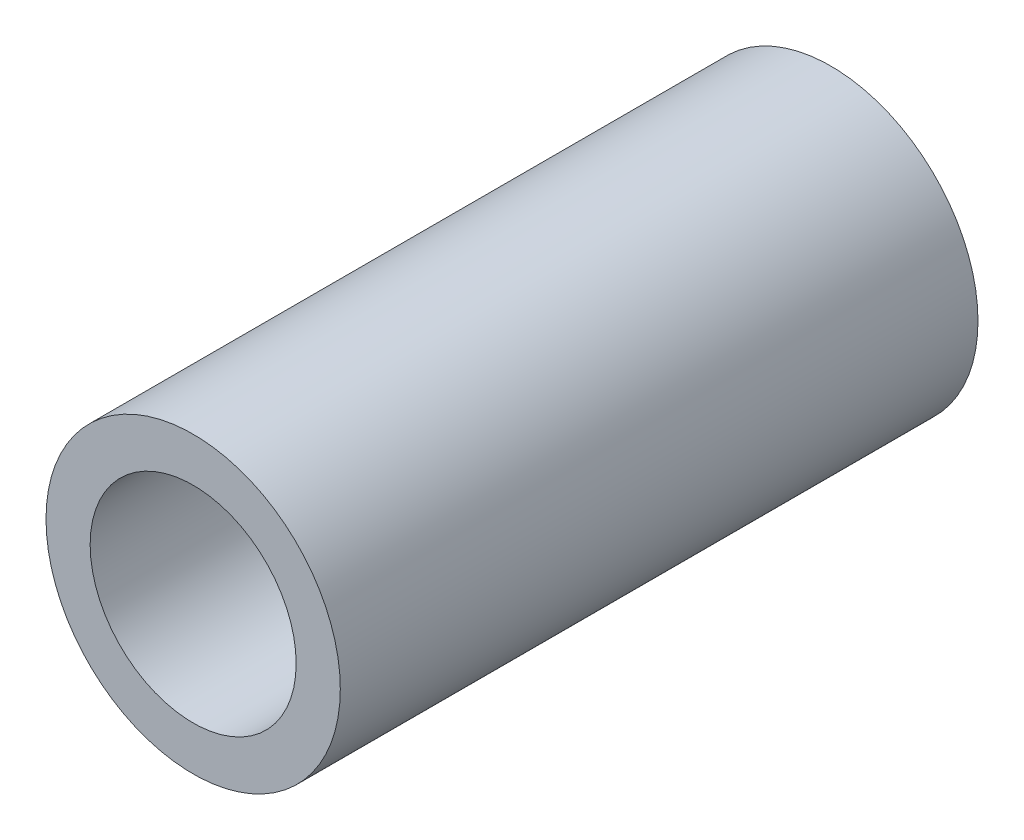
ISO-10303-21;
HEADER;
FILE_DESCRIPTION(('STEP AP214'),'2;1');
FILE_NAME('part.step','',(''),(''),'','','');
FILE_SCHEMA(('AUTOMOTIVE_DESIGN { 1 0 10303 214 1 1 1 1 }'));
ENDSEC;
DATA;
#1=APPLICATION_CONTEXT('core data for automotive mechanical design processes');
#2=APPLICATION_PROTOCOL_DEFINITION('international standard','automotive_design',2000,#1);
#3=PRODUCT_CONTEXT('',#1,'mechanical');
#4=PRODUCT('Part','Part','',(#3));
#5=PRODUCT_RELATED_PRODUCT_CATEGORY('part','',(#4));
#6=PRODUCT_DEFINITION_FORMATION('','',#4);
#7=PRODUCT_DEFINITION_CONTEXT('part definition',#1,'design');
#8=PRODUCT_DEFINITION('design','',#6,#7);
#9=PRODUCT_DEFINITION_SHAPE('','',#8);
#10=(LENGTH_UNIT() NAMED_UNIT(*) SI_UNIT(.MILLI.,.METRE.));
#11=(NAMED_UNIT(*) PLANE_ANGLE_UNIT() SI_UNIT($,.RADIAN.));
#12=(NAMED_UNIT(*) SI_UNIT($,.STERADIAN.) SOLID_ANGLE_UNIT());
#13=UNCERTAINTY_MEASURE_WITH_UNIT(LENGTH_MEASURE(1.E-05),#10,'distance_accuracy_value','');
#14=(GEOMETRIC_REPRESENTATION_CONTEXT(3) GLOBAL_UNCERTAINTY_ASSIGNED_CONTEXT((#13)) GLOBAL_UNIT_ASSIGNED_CONTEXT((#10,
#11,#12)) REPRESENTATION_CONTEXT('',''));
#15=CARTESIAN_POINT('',(0.,0.,0.));
#16=DIRECTION('',(0.,0.,1.));
#17=DIRECTION('',(1.,0.,0.));
#18=AXIS2_PLACEMENT_3D('',#15,#16,#17);
#19=CARTESIAN_POINT('',(0.,0.,13.));
#20=DIRECTION('',(0.,0.,1.));
#21=DIRECTION('',(1.,0.,0.));
#22=AXIS2_PLACEMENT_3D('',#19,#20,#21);
#23=PLANE('',#22);
#24=CARTESIAN_POINT('',(0.,0.,13.));
#25=DIRECTION('',(0.,0.,1.));
#26=DIRECTION('',(1.,0.,0.));
#27=AXIS2_PLACEMENT_3D('',#24,#25,#26);
#28=CIRCLE('',#27,3.);
#29=CARTESIAN_POINT('',(3.,0.,13.));
#30=VERTEX_POINT('',#29);
#31=EDGE_CURVE('E10',#30,#30,#28,.T.);
#32=ORIENTED_EDGE('',*,*,#31,.T.);
#33=EDGE_LOOP('',(#32));
#34=FACE_BOUND('',#33,.T.);
#35=CARTESIAN_POINT('',(0.,0.,13.));
#36=DIRECTION('',(0.,0.,1.));
#37=DIRECTION('',(1.,0.,0.));
#38=AXIS2_PLACEMENT_3D('',#35,#36,#37);
#39=CIRCLE('',#38,2.1);
#40=CARTESIAN_POINT('',(2.1,0.,13.));
#41=VERTEX_POINT('',#40);
#42=EDGE_CURVE('E41',#41,#41,#39,.T.);
#43=ORIENTED_EDGE('',*,*,#42,.F.);
#44=EDGE_LOOP('',(#43));
#45=FACE_BOUND('',#44,.T.);
#46=ADVANCED_FACE('F30',(#34,#45),#23,.T.);
#47=CARTESIAN_POINT('',(0.,0.,0.));
#48=DIRECTION('',(0.,0.,1.));
#49=DIRECTION('',(1.,0.,0.));
#50=AXIS2_PLACEMENT_3D('',#47,#48,#49);
#51=PLANE('',#50);
#52=CARTESIAN_POINT('',(0.,0.,0.));
#53=DIRECTION('',(0.,0.,1.));
#54=DIRECTION('',(1.,0.,0.));
#55=AXIS2_PLACEMENT_3D('',#52,#53,#54);
#56=CIRCLE('',#55,3.);
#57=CARTESIAN_POINT('',(3.,0.,0.));
#58=VERTEX_POINT('',#57);
#59=EDGE_CURVE('E34',#58,#58,#56,.T.);
#60=ORIENTED_EDGE('',*,*,#59,.F.);
#61=EDGE_LOOP('',(#60));
#62=FACE_BOUND('',#61,.T.);
#63=CARTESIAN_POINT('',(0.,0.,0.));
#64=DIRECTION('',(0.,0.,1.));
#65=DIRECTION('',(1.,0.,0.));
#66=AXIS2_PLACEMENT_3D('',#63,#64,#65);
#67=CIRCLE('',#66,2.1);
#68=CARTESIAN_POINT('',(2.1,0.,0.));
#69=VERTEX_POINT('',#68);
#70=EDGE_CURVE('E43',#69,#69,#67,.T.);
#71=ORIENTED_EDGE('',*,*,#70,.T.);
#72=EDGE_LOOP('',(#71));
#73=FACE_BOUND('',#72,.T.);
#74=ADVANCED_FACE('F53',(#62,#73),#51,.F.);
#75=CARTESIAN_POINT('',(0.,0.,13.));
#76=DIRECTION('',(0.,0.,-1.));
#77=DIRECTION('',(-1.,0.,0.));
#78=AXIS2_PLACEMENT_3D('',#75,#76,#77);
#79=CYLINDRICAL_SURFACE('',#78,3.);
#80=ORIENTED_EDGE('',*,*,#31,.F.);
#81=EDGE_LOOP('',(#80));
#82=FACE_BOUND('',#81,.T.);
#83=ORIENTED_EDGE('',*,*,#59,.T.);
#84=EDGE_LOOP('',(#83));
#85=FACE_BOUND('',#84,.T.);
#86=ADVANCED_FACE('F32',(#82,#85),#79,.T.);
#87=CARTESIAN_POINT('',(0.,0.,13.));
#88=DIRECTION('',(0.,0.,-1.));
#89=DIRECTION('',(-1.,0.,0.));
#90=AXIS2_PLACEMENT_3D('',#87,#88,#89);
#91=CYLINDRICAL_SURFACE('',#90,2.1);
#92=ORIENTED_EDGE('',*,*,#42,.T.);
#93=EDGE_LOOP('',(#92));
#94=FACE_BOUND('',#93,.T.);
#95=ORIENTED_EDGE('',*,*,#70,.F.);
#96=EDGE_LOOP('',(#95));
#97=FACE_BOUND('',#96,.T.);
#98=ADVANCED_FACE('F49',(#94,#97),#91,.F.);
#99=CLOSED_SHELL('',(#46,#74,#86,#98));
#100=MANIFOLD_SOLID_BREP('B2',#99);
#101=ADVANCED_BREP_SHAPE_REPRESENTATION('',(#18,#100),#14);
#102=SHAPE_DEFINITION_REPRESENTATION(#9,#101);
ENDSEC;
END-ISO-10303-21;
